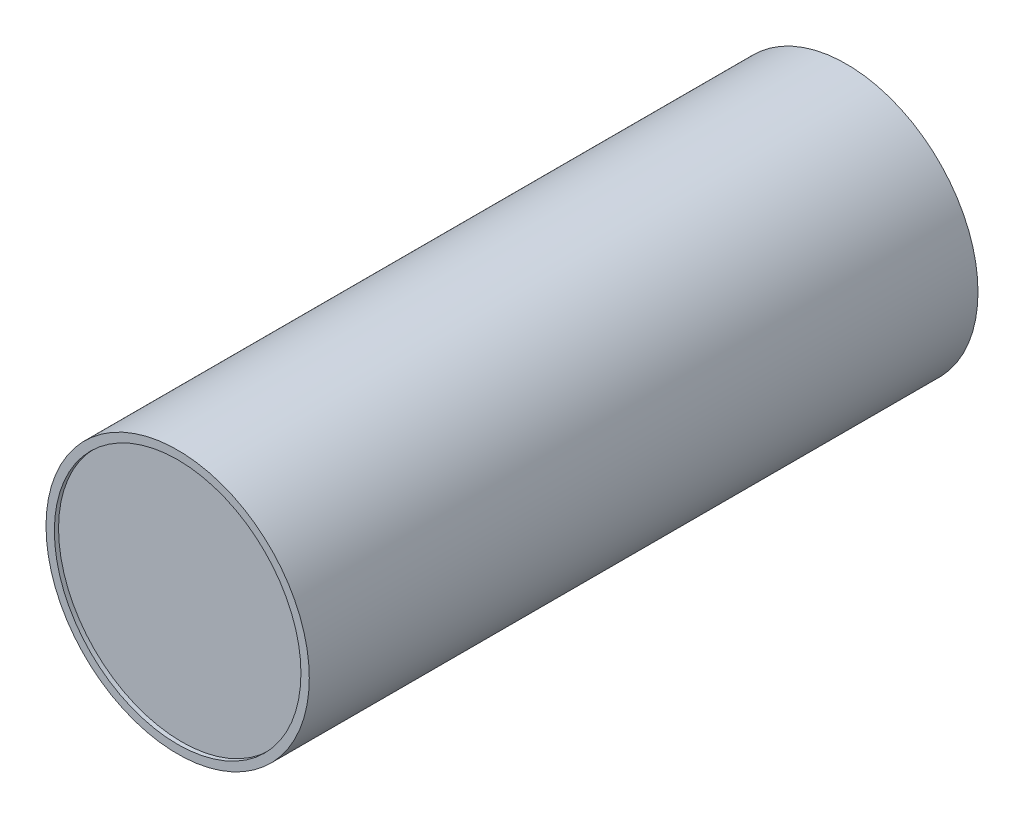
ISO-10303-21;
HEADER;
FILE_DESCRIPTION(('STEP AP214'),'2;1');
FILE_NAME('part.step','',(''),(''),'','','');
FILE_SCHEMA(('AUTOMOTIVE_DESIGN { 1 0 10303 214 1 1 1 1 }'));
ENDSEC;
DATA;
#1=APPLICATION_CONTEXT('core data for automotive mechanical design processes');
#2=APPLICATION_PROTOCOL_DEFINITION('international standard','automotive_design',2000,#1);
#3=PRODUCT_CONTEXT('',#1,'mechanical');
#4=PRODUCT('Part','Part','',(#3));
#5=PRODUCT_RELATED_PRODUCT_CATEGORY('part','',(#4));
#6=PRODUCT_DEFINITION_FORMATION('','',#4);
#7=PRODUCT_DEFINITION_CONTEXT('part definition',#1,'design');
#8=PRODUCT_DEFINITION('design','',#6,#7);
#9=PRODUCT_DEFINITION_SHAPE('','',#8);
#10=(LENGTH_UNIT() NAMED_UNIT(*) SI_UNIT(.MILLI.,.METRE.));
#11=(NAMED_UNIT(*) PLANE_ANGLE_UNIT() SI_UNIT($,.RADIAN.));
#12=(NAMED_UNIT(*) SI_UNIT($,.STERADIAN.) SOLID_ANGLE_UNIT());
#13=UNCERTAINTY_MEASURE_WITH_UNIT(LENGTH_MEASURE(1.E-05),#10,'distance_accuracy_value','');
#14=(GEOMETRIC_REPRESENTATION_CONTEXT(3) GLOBAL_UNCERTAINTY_ASSIGNED_CONTEXT((#13)) GLOBAL_UNIT_ASSIGNED_CONTEXT((#10,
#11,#12)) REPRESENTATION_CONTEXT('',''));
#15=CARTESIAN_POINT('',(0.,0.,0.));
#16=DIRECTION('',(0.,0.,1.));
#17=DIRECTION('',(1.,0.,0.));
#18=AXIS2_PLACEMENT_3D('',#15,#16,#17);
#19=CARTESIAN_POINT('',(0.,0.,160.));
#20=DIRECTION('',(0.,0.,-1.));
#21=DIRECTION('',(-1.,0.,0.));
#22=AXIS2_PLACEMENT_3D('',#19,#20,#21);
#23=CYLINDRICAL_SURFACE('',#22,29.5);
#24=CARTESIAN_POINT('',(0.,0.,159.));
#25=DIRECTION('',(0.,0.,1.));
#26=DIRECTION('',(1.,0.,0.));
#27=AXIS2_PLACEMENT_3D('',#24,#25,#26);
#28=CIRCLE('',#27,29.5);
#29=CARTESIAN_POINT('',(29.5,0.,159.));
#30=VERTEX_POINT('',#29);
#31=EDGE_CURVE('E10',#30,#30,#28,.T.);
#32=ORIENTED_EDGE('',*,*,#31,.F.);
#33=EDGE_LOOP('',(#32));
#34=FACE_BOUND('',#33,.T.);
#35=CARTESIAN_POINT('',(0.,0.,160.));
#36=DIRECTION('',(0.,0.,1.));
#37=DIRECTION('',(1.,0.,0.));
#38=AXIS2_PLACEMENT_3D('',#35,#36,#37);
#39=CIRCLE('',#38,29.5);
#40=CARTESIAN_POINT('',(29.5,0.,160.));
#41=VERTEX_POINT('',#40);
#42=EDGE_CURVE('E55',#41,#41,#39,.T.);
#43=ORIENTED_EDGE('',*,*,#42,.T.);
#44=EDGE_LOOP('',(#43));
#45=FACE_BOUND('',#44,.T.);
#46=ADVANCED_FACE('F32',(#34,#45),#23,.F.);
#47=CARTESIAN_POINT('',(0.,0.,160.));
#48=DIRECTION('',(0.,0.,1.));
#49=DIRECTION('',(1.,0.,0.));
#50=AXIS2_PLACEMENT_3D('',#47,#48,#49);
#51=PLANE('',#50);
#52=CARTESIAN_POINT('',(0.,0.,160.));
#53=DIRECTION('',(0.,0.,1.));
#54=DIRECTION('',(1.,0.,0.));
#55=AXIS2_PLACEMENT_3D('',#52,#53,#54);
#56=CIRCLE('',#55,31.5);
#57=CARTESIAN_POINT('',(31.5,0.,160.));
#58=VERTEX_POINT('',#57);
#59=EDGE_CURVE('E45',#58,#58,#56,.T.);
#60=ORIENTED_EDGE('',*,*,#59,.T.);
#61=EDGE_LOOP('',(#60));
#62=FACE_BOUND('',#61,.T.);
#63=ORIENTED_EDGE('',*,*,#42,.F.);
#64=EDGE_LOOP('',(#63));
#65=FACE_BOUND('',#64,.T.);
#66=ADVANCED_FACE('F64',(#62,#65),#51,.T.);
#67=CARTESIAN_POINT('',(0.,0.,0.));
#68=DIRECTION('',(0.,0.,1.));
#69=DIRECTION('',(1.,0.,0.));
#70=AXIS2_PLACEMENT_3D('',#67,#68,#69);
#71=PLANE('',#70);
#72=CARTESIAN_POINT('',(0.,0.,0.));
#73=DIRECTION('',(0.,0.,1.));
#74=DIRECTION('',(1.,0.,0.));
#75=AXIS2_PLACEMENT_3D('',#72,#73,#74);
#76=CIRCLE('',#75,31.5);
#77=CARTESIAN_POINT('',(31.5,0.,0.));
#78=VERTEX_POINT('',#77);
#79=EDGE_CURVE('E52',#78,#78,#76,.T.);
#80=ORIENTED_EDGE('',*,*,#79,.F.);
#81=EDGE_LOOP('',(#80));
#82=FACE_BOUND('',#81,.T.);
#83=CARTESIAN_POINT('',(0.,0.,0.));
#84=DIRECTION('',(0.,0.,1.));
#85=DIRECTION('',(1.,0.,0.));
#86=AXIS2_PLACEMENT_3D('',#83,#84,#85);
#87=CIRCLE('',#86,29.5);
#88=CARTESIAN_POINT('',(29.5,0.,0.));
#89=VERTEX_POINT('',#88);
#90=EDGE_CURVE('E50',#89,#89,#87,.T.);
#91=ORIENTED_EDGE('',*,*,#90,.T.);
#92=EDGE_LOOP('',(#91));
#93=FACE_BOUND('',#92,.T.);
#94=ADVANCED_FACE('F66',(#82,#93),#71,.F.);
#95=CARTESIAN_POINT('',(0.,0.,160.));
#96=DIRECTION('',(0.,0.,-1.));
#97=DIRECTION('',(-1.,0.,0.));
#98=AXIS2_PLACEMENT_3D('',#95,#96,#97);
#99=CYLINDRICAL_SURFACE('',#98,31.5);
#100=ORIENTED_EDGE('',*,*,#59,.F.);
#101=EDGE_LOOP('',(#100));
#102=FACE_BOUND('',#101,.T.);
#103=ORIENTED_EDGE('',*,*,#79,.T.);
#104=EDGE_LOOP('',(#103));
#105=FACE_BOUND('',#104,.T.);
#106=ADVANCED_FACE('F34',(#102,#105),#99,.T.);
#107=CARTESIAN_POINT('',(0.,0.,1.));
#108=DIRECTION('',(0.,0.,-1.));
#109=DIRECTION('',(-1.,0.,0.));
#110=AXIS2_PLACEMENT_3D('',#107,#108,#109);
#111=CIRCLE('',#110,29.5);
#112=CARTESIAN_POINT('',(-29.5,0.,1.));
#113=VERTEX_POINT('',#112);
#114=EDGE_CURVE('E41',#113,#113,#111,.T.);
#115=ORIENTED_EDGE('',*,*,#114,.F.);
#116=EDGE_LOOP('',(#115));
#117=FACE_BOUND('',#116,.T.);
#118=ORIENTED_EDGE('',*,*,#90,.F.);
#119=EDGE_LOOP('',(#118));
#120=FACE_BOUND('',#119,.T.);
#121=ADVANCED_FACE('F76',(#117,#120),#23,.F.);
#122=CARTESIAN_POINT('',(0.,0.,1.));
#123=DIRECTION('',(0.,0.,-1.));
#124=DIRECTION('',(-1.,0.,0.));
#125=AXIS2_PLACEMENT_3D('',#122,#123,#124);
#126=PLANE('',#125);
#127=ORIENTED_EDGE('',*,*,#114,.T.);
#128=EDGE_LOOP('',(#127));
#129=FACE_BOUND('',#128,.T.);
#130=ADVANCED_FACE('F80',(#129),#126,.T.);
#131=CARTESIAN_POINT('',(0.,0.,159.));
#132=DIRECTION('',(0.,0.,1.));
#133=DIRECTION('',(1.,0.,0.));
#134=AXIS2_PLACEMENT_3D('',#131,#132,#133);
#135=PLANE('',#134);
#136=ORIENTED_EDGE('',*,*,#31,.T.);
#137=EDGE_LOOP('',(#136));
#138=FACE_BOUND('',#137,.T.);
#139=ADVANCED_FACE('F84',(#138),#135,.T.);
#140=CLOSED_SHELL('',(#46,#66,#94,#106,#121,#130,#139));
#141=CARTESIAN_POINT('',(0.,0.,6.));
#142=DIRECTION('',(0.,0.,-1.));
#143=DIRECTION('',(-1.,0.,0.));
#144=AXIS2_PLACEMENT_3D('',#141,#142,#143);
#145=PLANE('',#144);
#146=CARTESIAN_POINT('',(0.,0.,6.00000000000001));
#147=DIRECTION('',(0.,0.,-1.));
#148=DIRECTION('',(-1.,0.,0.));
#149=AXIS2_PLACEMENT_3D('',#146,#147,#148);
#150=CIRCLE('',#149,29.5);
#151=CARTESIAN_POINT('',(-29.5,0.,6.00000000000001));
#152=VERTEX_POINT('',#151);
#153=EDGE_CURVE('E48',#152,#152,#150,.T.);
#154=ORIENTED_EDGE('',*,*,#153,.F.);
#155=EDGE_LOOP('',(#154));
#156=FACE_BOUND('',#155,.T.);
#157=ADVANCED_FACE('F86',(#156),#145,.F.);
#158=ORIENTED_EDGE('',*,*,#153,.T.);
#159=EDGE_LOOP('',(#158));
#160=FACE_BOUND('',#159,.T.);
#161=CARTESIAN_POINT('',(0.,0.,154.));
#162=DIRECTION('',(0.,0.,1.));
#163=DIRECTION('',(1.,0.,0.));
#164=AXIS2_PLACEMENT_3D('',#161,#162,#163);
#165=CIRCLE('',#164,29.5);
#166=CARTESIAN_POINT('',(29.5,0.,154.));
#167=VERTEX_POINT('',#166);
#168=EDGE_CURVE('E36',#167,#167,#165,.T.);
#169=ORIENTED_EDGE('',*,*,#168,.T.);
#170=EDGE_LOOP('',(#169));
#171=FACE_BOUND('',#170,.T.);
#172=ADVANCED_FACE('F77',(#160,#171),#23,.F.);
#173=CARTESIAN_POINT('',(0.,0.,154.));
#174=DIRECTION('',(0.,0.,1.));
#175=DIRECTION('',(1.,0.,0.));
#176=AXIS2_PLACEMENT_3D('',#173,#174,#175);
#177=PLANE('',#176);
#178=ORIENTED_EDGE('',*,*,#168,.F.);
#179=EDGE_LOOP('',(#178));
#180=FACE_BOUND('',#179,.T.);
#181=ADVANCED_FACE('F93',(#180),#177,.F.);
#182=CLOSED_SHELL('',(#157,#172,#181));
#183=ORIENTED_CLOSED_SHELL('',*,#182,.T.);
#184=BREP_WITH_VOIDS('B2',#140,(#183));
#185=ADVANCED_BREP_SHAPE_REPRESENTATION('',(#18,#184),#14);
#186=SHAPE_DEFINITION_REPRESENTATION(#9,#185);
ENDSEC;
END-ISO-10303-21;
